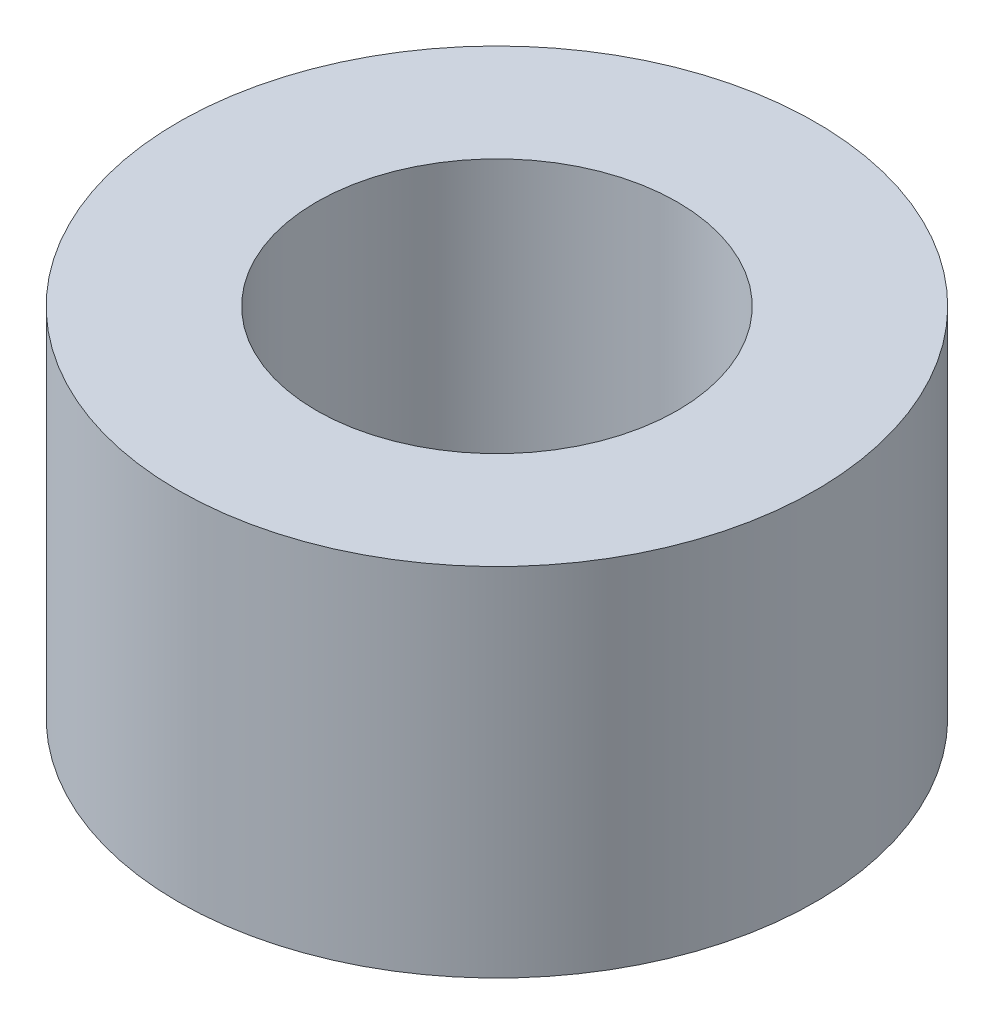
ISO-10303-21;
HEADER;
FILE_DESCRIPTION(('STEP AP214'),'2;1');
FILE_NAME('part.step','',(''),(''),'','','');
FILE_SCHEMA(('AUTOMOTIVE_DESIGN { 1 0 10303 214 1 1 1 1 }'));
ENDSEC;
DATA;
#1=APPLICATION_CONTEXT('core data for automotive mechanical design processes');
#2=APPLICATION_PROTOCOL_DEFINITION('international standard','automotive_design',2000,#1);
#3=PRODUCT_CONTEXT('',#1,'mechanical');
#4=PRODUCT('Part','Part','',(#3));
#5=PRODUCT_RELATED_PRODUCT_CATEGORY('part','',(#4));
#6=PRODUCT_DEFINITION_FORMATION('','',#4);
#7=PRODUCT_DEFINITION_CONTEXT('part definition',#1,'design');
#8=PRODUCT_DEFINITION('design','',#6,#7);
#9=PRODUCT_DEFINITION_SHAPE('','',#8);
#10=(LENGTH_UNIT() NAMED_UNIT(*) SI_UNIT(.MILLI.,.METRE.));
#11=(NAMED_UNIT(*) PLANE_ANGLE_UNIT() SI_UNIT($,.RADIAN.));
#12=(NAMED_UNIT(*) SI_UNIT($,.STERADIAN.) SOLID_ANGLE_UNIT());
#13=UNCERTAINTY_MEASURE_WITH_UNIT(LENGTH_MEASURE(1.E-05),#10,'distance_accuracy_value','');
#14=(GEOMETRIC_REPRESENTATION_CONTEXT(3) GLOBAL_UNCERTAINTY_ASSIGNED_CONTEXT((#13)) GLOBAL_UNIT_ASSIGNED_CONTEXT((#10,
#11,#12)) REPRESENTATION_CONTEXT('',''));
#15=CARTESIAN_POINT('',(0.,0.,0.));
#16=DIRECTION('',(0.,0.,1.));
#17=DIRECTION('',(1.,0.,0.));
#18=AXIS2_PLACEMENT_3D('',#15,#16,#17);
#19=CARTESIAN_POINT('',(0.,6.35,0.));
#20=DIRECTION('',(0.,1.,0.));
#21=DIRECTION('',(0.,0.,1.));
#22=AXIS2_PLACEMENT_3D('',#19,#20,#21);
#23=PLANE('',#22);
#24=CARTESIAN_POINT('',(0.,6.35,0.));
#25=DIRECTION('',(0.,1.,0.));
#26=DIRECTION('',(0.,0.,1.));
#27=AXIS2_PLACEMENT_3D('',#24,#25,#26);
#28=CIRCLE('',#27,5.67930203868489);
#29=CARTESIAN_POINT('',(0.,6.35,5.67930203868489));
#30=VERTEX_POINT('',#29);
#31=EDGE_CURVE('E11',#30,#30,#28,.T.);
#32=ORIENTED_EDGE('',*,*,#31,.T.);
#33=EDGE_LOOP('',(#32));
#34=FACE_BOUND('',#33,.T.);
#35=CARTESIAN_POINT('',(0.,6.35,0.));
#36=DIRECTION('',(0.,1.,0.));
#37=DIRECTION('',(0.,0.,1.));
#38=AXIS2_PLACEMENT_3D('',#35,#36,#37);
#39=CIRCLE('',#38,3.21677586978556);
#40=CARTESIAN_POINT('',(0.,6.35,3.21677586978556));
#41=VERTEX_POINT('',#40);
#42=EDGE_CURVE('E49',#41,#41,#39,.T.);
#43=ORIENTED_EDGE('',*,*,#42,.F.);
#44=EDGE_LOOP('',(#43));
#45=FACE_BOUND('',#44,.T.);
#46=ADVANCED_FACE('F38',(#34,#45),#23,.T.);
#47=CARTESIAN_POINT('',(0.,0.,0.));
#48=DIRECTION('',(0.,1.,0.));
#49=DIRECTION('',(0.,0.,1.));
#50=AXIS2_PLACEMENT_3D('',#47,#48,#49);
#51=PLANE('',#50);
#52=CARTESIAN_POINT('',(0.,0.,0.));
#53=DIRECTION('',(0.,1.,0.));
#54=DIRECTION('',(0.,0.,1.));
#55=AXIS2_PLACEMENT_3D('',#52,#53,#54);
#56=CIRCLE('',#55,5.67930203868489);
#57=CARTESIAN_POINT('',(0.,0.,5.67930203868489));
#58=VERTEX_POINT('',#57);
#59=EDGE_CURVE('E42',#58,#58,#56,.T.);
#60=ORIENTED_EDGE('',*,*,#59,.F.);
#61=EDGE_LOOP('',(#60));
#62=FACE_BOUND('',#61,.T.);
#63=CARTESIAN_POINT('',(0.,0.,0.));
#64=DIRECTION('',(0.,1.,0.));
#65=DIRECTION('',(0.,0.,1.));
#66=AXIS2_PLACEMENT_3D('',#63,#64,#65);
#67=CIRCLE('',#66,3.21677586978556);
#68=CARTESIAN_POINT('',(0.,0.,3.21677586978556));
#69=VERTEX_POINT('',#68);
#70=EDGE_CURVE('E51',#69,#69,#67,.T.);
#71=ORIENTED_EDGE('',*,*,#70,.T.);
#72=EDGE_LOOP('',(#71));
#73=FACE_BOUND('',#72,.T.);
#74=ADVANCED_FACE('F61',(#62,#73),#51,.F.);
#75=CARTESIAN_POINT('',(0.,6.35,0.));
#76=DIRECTION('',(0.,-1.,0.));
#77=DIRECTION('',(0.,0.,-1.));
#78=AXIS2_PLACEMENT_3D('',#75,#76,#77);
#79=CYLINDRICAL_SURFACE('',#78,5.67930203868489);
#80=ORIENTED_EDGE('',*,*,#31,.F.);
#81=EDGE_LOOP('',(#80));
#82=FACE_BOUND('',#81,.T.);
#83=ORIENTED_EDGE('',*,*,#59,.T.);
#84=EDGE_LOOP('',(#83));
#85=FACE_BOUND('',#84,.T.);
#86=ADVANCED_FACE('F40',(#82,#85),#79,.T.);
#87=CARTESIAN_POINT('',(0.,6.35,0.));
#88=DIRECTION('',(0.,-1.,0.));
#89=DIRECTION('',(0.,0.,-1.));
#90=AXIS2_PLACEMENT_3D('',#87,#88,#89);
#91=CYLINDRICAL_SURFACE('',#90,3.21677586978556);
#92=ORIENTED_EDGE('',*,*,#42,.T.);
#93=EDGE_LOOP('',(#92));
#94=FACE_BOUND('',#93,.T.);
#95=ORIENTED_EDGE('',*,*,#70,.F.);
#96=EDGE_LOOP('',(#95));
#97=FACE_BOUND('',#96,.T.);
#98=ADVANCED_FACE('F57',(#94,#97),#91,.F.);
#99=CLOSED_SHELL('',(#46,#74,#86,#98));
#100=MANIFOLD_SOLID_BREP('B2',#99);
#101=ADVANCED_BREP_SHAPE_REPRESENTATION('',(#18,#100),#14);
#102=SHAPE_DEFINITION_REPRESENTATION(#9,#101);
ENDSEC;
END-ISO-10303-21;
